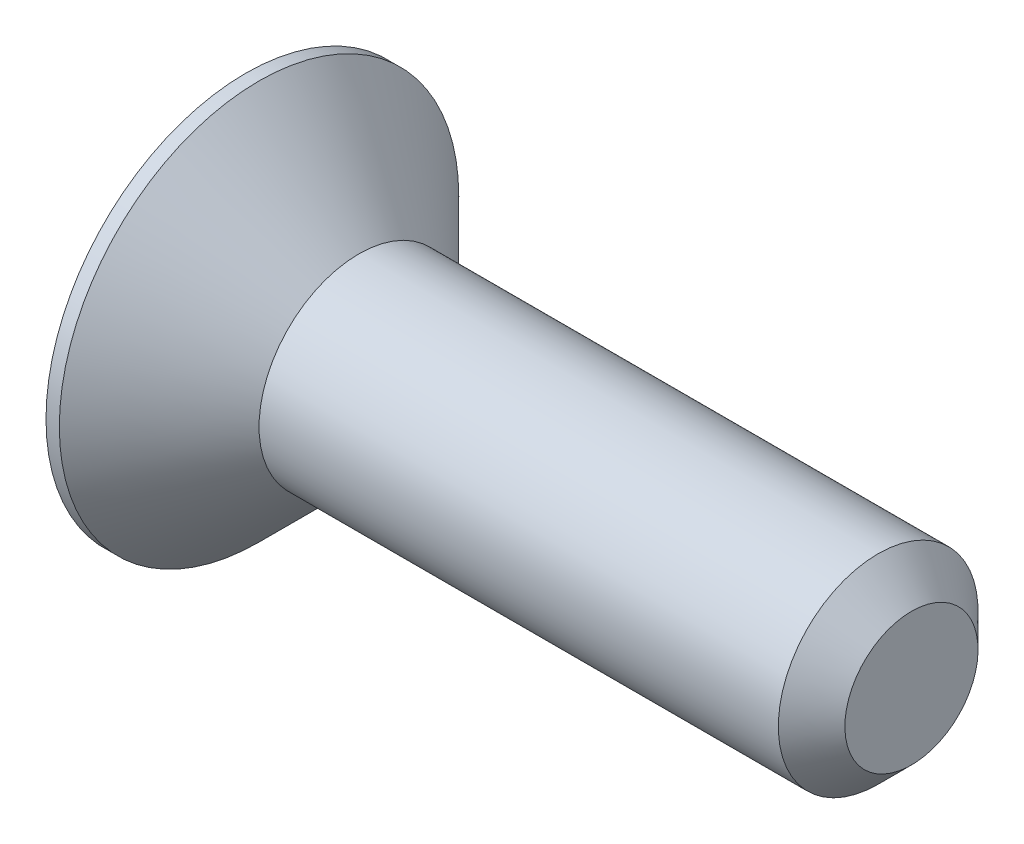
ISO-10303-21;
HEADER;
FILE_DESCRIPTION(('STEP AP214'),'2;1');
FILE_NAME('part.step','',(''),(''),'','','');
FILE_SCHEMA(('AUTOMOTIVE_DESIGN { 1 0 10303 214 1 1 1 1 }'));
ENDSEC;
DATA;
#1=APPLICATION_CONTEXT('core data for automotive mechanical design processes');
#2=APPLICATION_PROTOCOL_DEFINITION('international standard','automotive_design',2000,#1);
#3=PRODUCT_CONTEXT('',#1,'mechanical');
#4=PRODUCT('Part','Part','',(#3));
#5=PRODUCT_RELATED_PRODUCT_CATEGORY('part','',(#4));
#6=PRODUCT_DEFINITION_FORMATION('','',#4);
#7=PRODUCT_DEFINITION_CONTEXT('part definition',#1,'design');
#8=PRODUCT_DEFINITION('design','',#6,#7);
#9=PRODUCT_DEFINITION_SHAPE('','',#8);
#10=(LENGTH_UNIT() NAMED_UNIT(*) SI_UNIT(.MILLI.,.METRE.));
#11=(NAMED_UNIT(*) PLANE_ANGLE_UNIT() SI_UNIT($,.RADIAN.));
#12=(NAMED_UNIT(*) SI_UNIT($,.STERADIAN.) SOLID_ANGLE_UNIT());
#13=UNCERTAINTY_MEASURE_WITH_UNIT(LENGTH_MEASURE(1.E-05),#10,'distance_accuracy_value','');
#14=(GEOMETRIC_REPRESENTATION_CONTEXT(3) GLOBAL_UNCERTAINTY_ASSIGNED_CONTEXT((#13)) GLOBAL_UNIT_ASSIGNED_CONTEXT((#10,
#11,#12)) REPRESENTATION_CONTEXT('',''));
#15=CARTESIAN_POINT('',(0.,0.,0.));
#16=DIRECTION('',(0.,0.,1.));
#17=DIRECTION('',(1.,0.,0.));
#18=AXIS2_PLACEMENT_3D('',#15,#16,#17);
#19=CARTESIAN_POINT('',(0.,0.,0.));
#20=DIRECTION('',(-1.,0.,0.));
#21=DIRECTION('',(0.,-1.,0.));
#22=AXIS2_PLACEMENT_3D('',#19,#20,#21);
#23=PLANE('',#22);
#24=DIRECTION('',(0.,0.5,-0.866025403784438));
#25=VECTOR('',#24,1.);
#26=CARTESIAN_POINT('',(0.,0.577350269189626,1.));
#27=LINE('',#26,#25);
#28=CARTESIAN_POINT('',(0.,0.577350269189626,1.));
#29=VERTEX_POINT('',#28);
#30=CARTESIAN_POINT('',(0.,1.15470053837925,0.));
#31=VERTEX_POINT('',#30);
#32=EDGE_CURVE('E47',#29,#31,#27,.T.);
#33=ORIENTED_EDGE('',*,*,#32,.F.);
#34=DIRECTION('',(0.,1.,0.));
#35=VECTOR('',#34,1.);
#36=CARTESIAN_POINT('',(0.,-0.577350269189626,1.));
#37=LINE('',#36,#35);
#38=CARTESIAN_POINT('',(0.,-0.577350269189626,1.));
#39=VERTEX_POINT('',#38);
#40=EDGE_CURVE('E130',#39,#29,#37,.T.);
#41=ORIENTED_EDGE('',*,*,#40,.F.);
#42=DIRECTION('',(0.,0.5,0.866025403784439));
#43=VECTOR('',#42,1.);
#44=CARTESIAN_POINT('',(0.,-1.15470053837925,0.));
#45=LINE('',#44,#43);
#46=CARTESIAN_POINT('',(0.,-1.15470053837925,0.));
#47=VERTEX_POINT('',#46);
#48=EDGE_CURVE('E128',#47,#39,#45,.T.);
#49=ORIENTED_EDGE('',*,*,#48,.F.);
#50=DIRECTION('',(0.,-0.5,0.866025403784439));
#51=VECTOR('',#50,1.);
#52=CARTESIAN_POINT('',(0.,-0.577350269189625,-1.));
#53=LINE('',#52,#51);
#54=CARTESIAN_POINT('',(0.,-0.577350269189625,-1.));
#55=VERTEX_POINT('',#54);
#56=EDGE_CURVE('E95',#55,#47,#53,.T.);
#57=ORIENTED_EDGE('',*,*,#56,.F.);
#58=DIRECTION('',(0.,-1.,0.));
#59=VECTOR('',#58,1.);
#60=CARTESIAN_POINT('',(0.,0.577350269189626,-1.));
#61=LINE('',#60,#59);
#62=CARTESIAN_POINT('',(0.,0.577350269189626,-1.));
#63=VERTEX_POINT('',#62);
#64=EDGE_CURVE('E124',#63,#55,#61,.T.);
#65=ORIENTED_EDGE('',*,*,#64,.F.);
#66=DIRECTION('',(0.,-0.5,-0.866025403784439));
#67=VECTOR('',#66,1.);
#68=CARTESIAN_POINT('',(0.,1.15470053837925,0.));
#69=LINE('',#68,#67);
#70=EDGE_CURVE('E121',#31,#63,#69,.T.);
#71=ORIENTED_EDGE('',*,*,#70,.F.);
#72=EDGE_LOOP('',(#33,#41,#49,#57,#65,#71));
#73=FACE_BOUND('',#72,.T.);
#74=CARTESIAN_POINT('',(0.,0.,0.));
#75=DIRECTION('',(1.,0.,0.));
#76=DIRECTION('',(0.,1.,0.));
#77=AXIS2_PLACEMENT_3D('',#74,#75,#76);
#78=CIRCLE('',#77,3.);
#79=CARTESIAN_POINT('',(0.,3.,0.));
#80=VERTEX_POINT('',#79);
#81=EDGE_CURVE('E145',#80,#80,#78,.T.);
#82=ORIENTED_EDGE('',*,*,#81,.F.);
#83=EDGE_LOOP('',(#82));
#84=FACE_BOUND('',#83,.T.);
#85=ADVANCED_FACE('F32',(#73,#84),#23,.T.);
#86=CARTESIAN_POINT('',(10.,0.,0.));
#87=DIRECTION('',(1.,0.,0.));
#88=DIRECTION('',(0.,1.,0.));
#89=AXIS2_PLACEMENT_3D('',#86,#87,#88);
#90=CYLINDRICAL_SURFACE('',#89,3.);
#91=ORIENTED_EDGE('',*,*,#81,.T.);
#92=EDGE_LOOP('',(#91));
#93=FACE_BOUND('',#92,.T.);
#94=CARTESIAN_POINT('',(0.199999999999962,0.,0.));
#95=DIRECTION('',(1.,0.,0.));
#96=DIRECTION('',(0.,1.,0.));
#97=AXIS2_PLACEMENT_3D('',#94,#95,#96);
#98=CIRCLE('',#97,3.);
#99=CARTESIAN_POINT('',(0.199999999999963,3.,0.));
#100=VERTEX_POINT('',#99);
#101=EDGE_CURVE('E142',#100,#100,#98,.T.);
#102=ORIENTED_EDGE('',*,*,#101,.F.);
#103=EDGE_LOOP('',(#102));
#104=FACE_BOUND('',#103,.T.);
#105=ADVANCED_FACE('F165',(#93,#104),#90,.T.);
#106=CARTESIAN_POINT('',(1.7,0.,0.));
#107=DIRECTION('',(-1.,0.,0.));
#108=DIRECTION('',(0.,-1.,0.));
#109=AXIS2_PLACEMENT_3D('',#106,#107,#108);
#110=CONICAL_SURFACE('',#109,1.5,0.785398163397436);
#111=ORIENTED_EDGE('',*,*,#101,.T.);
#112=EDGE_LOOP('',(#111));
#113=FACE_BOUND('',#112,.T.);
#114=CARTESIAN_POINT('',(1.7,0.,0.));
#115=DIRECTION('',(1.,0.,0.));
#116=DIRECTION('',(0.,1.,0.));
#117=AXIS2_PLACEMENT_3D('',#114,#115,#116);
#118=CIRCLE('',#117,1.5);
#119=CARTESIAN_POINT('',(1.7,1.5,0.));
#120=VERTEX_POINT('',#119);
#121=EDGE_CURVE('E134',#120,#120,#118,.T.);
#122=ORIENTED_EDGE('',*,*,#121,.F.);
#123=EDGE_LOOP('',(#122));
#124=FACE_BOUND('',#123,.T.);
#125=ADVANCED_FACE('F170',(#113,#124),#110,.T.);
#126=CARTESIAN_POINT('',(10.,0.,0.));
#127=DIRECTION('',(1.,0.,0.));
#128=DIRECTION('',(0.,1.,0.));
#129=AXIS2_PLACEMENT_3D('',#126,#127,#128);
#130=CYLINDRICAL_SURFACE('',#129,1.5);
#131=CARTESIAN_POINT('',(9.5,0.,0.));
#132=DIRECTION('',(1.,0.,0.));
#133=DIRECTION('',(0.,1.,0.));
#134=AXIS2_PLACEMENT_3D('',#131,#132,#133);
#135=CIRCLE('',#134,1.5);
#136=CARTESIAN_POINT('',(9.5,1.5,0.));
#137=VERTEX_POINT('',#136);
#138=EDGE_CURVE('E11',#137,#137,#135,.F.);
#139=ORIENTED_EDGE('',*,*,#138,.T.);
#140=EDGE_LOOP('',(#139));
#141=FACE_BOUND('',#140,.T.);
#142=ORIENTED_EDGE('',*,*,#121,.T.);
#143=EDGE_LOOP('',(#142));
#144=FACE_BOUND('',#143,.T.);
#145=ADVANCED_FACE('F161',(#141,#144),#130,.T.);
#146=CARTESIAN_POINT('',(10.,1.5,0.));
#147=DIRECTION('',(1.,0.,0.));
#148=DIRECTION('',(0.,1.,0.));
#149=AXIS2_PLACEMENT_3D('',#146,#147,#148);
#150=PLANE('',#149);
#151=CARTESIAN_POINT('',(10.,0.,0.));
#152=DIRECTION('',(1.,0.,0.));
#153=DIRECTION('',(0.,1.,0.));
#154=AXIS2_PLACEMENT_3D('',#151,#152,#153);
#155=CIRCLE('',#154,0.999999999999998);
#156=CARTESIAN_POINT('',(10.,0.999999999999995,0.));
#157=VERTEX_POINT('',#156);
#158=EDGE_CURVE('E40',#157,#157,#155,.T.);
#159=ORIENTED_EDGE('',*,*,#158,.T.);
#160=EDGE_LOOP('',(#159));
#161=FACE_BOUND('',#160,.T.);
#162=ADVANCED_FACE('F150',(#161),#150,.T.);
#163=CARTESIAN_POINT('',(10.,0.,0.));
#164=DIRECTION('',(-1.,0.,0.));
#165=DIRECTION('',(0.,-1.,0.));
#166=AXIS2_PLACEMENT_3D('',#163,#164,#165);
#167=CONICAL_SURFACE('',#166,0.999999999999998,0.785398163397447);
#168=ORIENTED_EDGE('',*,*,#138,.F.);
#169=EDGE_LOOP('',(#168));
#170=FACE_BOUND('',#169,.T.);
#171=ORIENTED_EDGE('',*,*,#158,.F.);
#172=EDGE_LOOP('',(#171));
#173=FACE_BOUND('',#172,.T.);
#174=ADVANCED_FACE('F34',(#170,#173),#167,.T.);
#175=CARTESIAN_POINT('',(1.2,0.577350269189626,1.));
#176=DIRECTION('',(0.,0.866025403784439,0.5));
#177=DIRECTION('',(0.,-0.5,0.866025403784439));
#178=AXIS2_PLACEMENT_3D('',#175,#176,#177);
#179=PLANE('',#178);
#180=ORIENTED_EDGE('',*,*,#32,.T.);
#181=DIRECTION('',(-1.,0.,0.));
#182=VECTOR('',#181,1.);
#183=CARTESIAN_POINT('',(1.2,1.15470053837925,0.));
#184=LINE('',#183,#182);
#185=CARTESIAN_POINT('',(1.2,1.15470053837925,0.));
#186=VERTEX_POINT('',#185);
#187=EDGE_CURVE('E77',#186,#31,#184,.T.);
#188=ORIENTED_EDGE('',*,*,#187,.F.);
#189=DIRECTION('',(0.,0.5,-0.866025403784438));
#190=VECTOR('',#189,1.);
#191=CARTESIAN_POINT('',(1.2,0.577350269189626,1.));
#192=LINE('',#191,#190);
#193=CARTESIAN_POINT('',(1.2,0.577350269189626,1.));
#194=VERTEX_POINT('',#193);
#195=EDGE_CURVE('E132',#194,#186,#192,.T.);
#196=ORIENTED_EDGE('',*,*,#195,.F.);
#197=DIRECTION('',(-1.,0.,0.));
#198=VECTOR('',#197,1.);
#199=CARTESIAN_POINT('',(1.2,0.577350269189626,1.));
#200=LINE('',#199,#198);
#201=EDGE_CURVE('E55',#194,#29,#200,.T.);
#202=ORIENTED_EDGE('',*,*,#201,.T.);
#203=EDGE_LOOP('',(#180,#188,#196,#202));
#204=FACE_BOUND('',#203,.T.);
#205=ADVANCED_FACE('F153',(#204),#179,.F.);
#206=CARTESIAN_POINT('',(1.2,-0.577350269189627,1.));
#207=DIRECTION('',(0.,0.,1.));
#208=DIRECTION('',(0.,-1.,0.));
#209=AXIS2_PLACEMENT_3D('',#206,#207,#208);
#210=PLANE('',#209);
#211=ORIENTED_EDGE('',*,*,#40,.T.);
#212=ORIENTED_EDGE('',*,*,#201,.F.);
#213=DIRECTION('',(0.,1.,0.));
#214=VECTOR('',#213,1.);
#215=CARTESIAN_POINT('',(1.2,-0.577350269189627,1.));
#216=LINE('',#215,#214);
#217=CARTESIAN_POINT('',(1.2,-0.577350269189627,1.));
#218=VERTEX_POINT('',#217);
#219=EDGE_CURVE('E107',#218,#194,#216,.T.);
#220=ORIENTED_EDGE('',*,*,#219,.F.);
#221=DIRECTION('',(-1.,0.,0.));
#222=VECTOR('',#221,1.);
#223=CARTESIAN_POINT('',(1.2,-0.577350269189627,1.));
#224=LINE('',#223,#222);
#225=EDGE_CURVE('E99',#218,#39,#224,.T.);
#226=ORIENTED_EDGE('',*,*,#225,.T.);
#227=EDGE_LOOP('',(#211,#212,#220,#226));
#228=FACE_BOUND('',#227,.T.);
#229=ADVANCED_FACE('F159',(#228),#210,.F.);
#230=CARTESIAN_POINT('',(1.2,-1.15470053837925,0.));
#231=DIRECTION('',(0.,-0.866025403784439,0.5));
#232=DIRECTION('',(0.,-0.5,-0.866025403784439));
#233=AXIS2_PLACEMENT_3D('',#230,#231,#232);
#234=PLANE('',#233);
#235=ORIENTED_EDGE('',*,*,#48,.T.);
#236=ORIENTED_EDGE('',*,*,#225,.F.);
#237=DIRECTION('',(0.,0.5,0.866025403784439));
#238=VECTOR('',#237,1.);
#239=CARTESIAN_POINT('',(1.2,-1.15470053837925,0.));
#240=LINE('',#239,#238);
#241=CARTESIAN_POINT('',(1.2,-1.15470053837925,0.));
#242=VERTEX_POINT('',#241);
#243=EDGE_CURVE('E103',#242,#218,#240,.T.);
#244=ORIENTED_EDGE('',*,*,#243,.F.);
#245=DIRECTION('',(-1.,0.,0.));
#246=VECTOR('',#245,1.);
#247=CARTESIAN_POINT('',(1.2,-1.15470053837925,0.));
#248=LINE('',#247,#246);
#249=EDGE_CURVE('E88',#242,#47,#248,.T.);
#250=ORIENTED_EDGE('',*,*,#249,.T.);
#251=EDGE_LOOP('',(#235,#236,#244,#250));
#252=FACE_BOUND('',#251,.T.);
#253=ADVANCED_FACE('F104',(#252),#234,.F.);
#254=CARTESIAN_POINT('',(1.2,-0.577350269189626,-1.));
#255=DIRECTION('',(0.,-0.866025403784439,-0.5));
#256=DIRECTION('',(0.,0.5,-0.866025403784439));
#257=AXIS2_PLACEMENT_3D('',#254,#255,#256);
#258=PLANE('',#257);
#259=ORIENTED_EDGE('',*,*,#56,.T.);
#260=ORIENTED_EDGE('',*,*,#249,.F.);
#261=DIRECTION('',(0.,-0.5,0.866025403784439));
#262=VECTOR('',#261,1.);
#263=CARTESIAN_POINT('',(1.2,-0.577350269189626,-1.));
#264=LINE('',#263,#262);
#265=CARTESIAN_POINT('',(1.2,-0.577350269189626,-1.));
#266=VERTEX_POINT('',#265);
#267=EDGE_CURVE('E92',#266,#242,#264,.T.);
#268=ORIENTED_EDGE('',*,*,#267,.F.);
#269=DIRECTION('',(-1.,0.,0.));
#270=VECTOR('',#269,1.);
#271=CARTESIAN_POINT('',(1.2,-0.577350269189626,-1.));
#272=LINE('',#271,#270);
#273=EDGE_CURVE('E100',#266,#55,#272,.T.);
#274=ORIENTED_EDGE('',*,*,#273,.T.);
#275=EDGE_LOOP('',(#259,#260,#268,#274));
#276=FACE_BOUND('',#275,.T.);
#277=ADVANCED_FACE('F90',(#276),#258,.F.);
#278=CARTESIAN_POINT('',(1.2,0.577350269189626,-1.));
#279=DIRECTION('',(0.,0.,-1.));
#280=DIRECTION('',(-1.,0.,0.));
#281=AXIS2_PLACEMENT_3D('',#278,#279,#280);
#282=PLANE('',#281);
#283=ORIENTED_EDGE('',*,*,#64,.T.);
#284=ORIENTED_EDGE('',*,*,#273,.F.);
#285=DIRECTION('',(0.,-1.,0.));
#286=VECTOR('',#285,1.);
#287=CARTESIAN_POINT('',(1.2,0.577350269189626,-1.));
#288=LINE('',#287,#286);
#289=CARTESIAN_POINT('',(1.2,0.577350269189626,-1.));
#290=VERTEX_POINT('',#289);
#291=EDGE_CURVE('E113',#290,#266,#288,.T.);
#292=ORIENTED_EDGE('',*,*,#291,.F.);
#293=DIRECTION('',(-1.,0.,0.));
#294=VECTOR('',#293,1.);
#295=CARTESIAN_POINT('',(1.2,0.577350269189626,-1.));
#296=LINE('',#295,#294);
#297=EDGE_CURVE('E137',#290,#63,#296,.T.);
#298=ORIENTED_EDGE('',*,*,#297,.T.);
#299=EDGE_LOOP('',(#283,#284,#292,#298));
#300=FACE_BOUND('',#299,.T.);
#301=ADVANCED_FACE('F184',(#300),#282,.F.);
#302=CARTESIAN_POINT('',(1.2,1.15470053837925,0.));
#303=DIRECTION('',(0.,0.866025403784439,-0.5));
#304=DIRECTION('',(0.,0.5,0.866025403784439));
#305=AXIS2_PLACEMENT_3D('',#302,#303,#304);
#306=PLANE('',#305);
#307=ORIENTED_EDGE('',*,*,#70,.T.);
#308=ORIENTED_EDGE('',*,*,#297,.F.);
#309=DIRECTION('',(0.,-0.5,-0.866025403784439));
#310=VECTOR('',#309,1.);
#311=CARTESIAN_POINT('',(1.2,1.15470053837925,0.));
#312=LINE('',#311,#310);
#313=EDGE_CURVE('E115',#186,#290,#312,.T.);
#314=ORIENTED_EDGE('',*,*,#313,.F.);
#315=ORIENTED_EDGE('',*,*,#187,.T.);
#316=EDGE_LOOP('',(#307,#308,#314,#315));
#317=FACE_BOUND('',#316,.T.);
#318=ADVANCED_FACE('F181',(#317),#306,.F.);
#319=CARTESIAN_POINT('',(1.2,0.,0.));
#320=DIRECTION('',(-1.,0.,0.));
#321=DIRECTION('',(0.,-1.,0.));
#322=AXIS2_PLACEMENT_3D('',#319,#320,#321);
#323=PLANE('',#322);
#324=ORIENTED_EDGE('',*,*,#195,.T.);
#325=ORIENTED_EDGE('',*,*,#313,.T.);
#326=ORIENTED_EDGE('',*,*,#291,.T.);
#327=ORIENTED_EDGE('',*,*,#267,.T.);
#328=ORIENTED_EDGE('',*,*,#243,.T.);
#329=ORIENTED_EDGE('',*,*,#219,.T.);
#330=EDGE_LOOP('',(#324,#325,#326,#327,#328,#329));
#331=FACE_BOUND('',#330,.T.);
#332=ADVANCED_FACE('F110',(#331),#323,.T.);
#333=CLOSED_SHELL('',(#85,#105,#125,#145,#162,#174,#205,#229,#253,#277,#301,#318,#332));
#334=MANIFOLD_SOLID_BREP('B2',#333);
#335=ADVANCED_BREP_SHAPE_REPRESENTATION('',(#18,#334),#14);
#336=SHAPE_DEFINITION_REPRESENTATION(#9,#335);
ENDSEC;
END-ISO-10303-21;
